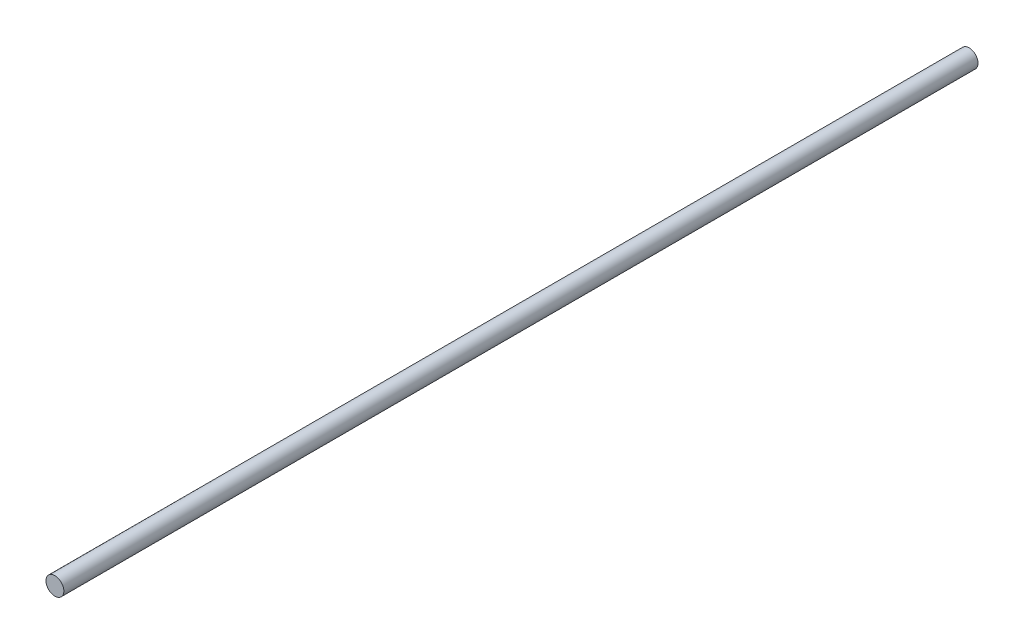
ISO-10303-21;
HEADER;
FILE_DESCRIPTION(('STEP AP214'),'2;1');
FILE_NAME('part.step','',(''),(''),'','','');
FILE_SCHEMA(('AUTOMOTIVE_DESIGN { 1 0 10303 214 1 1 1 1 }'));
ENDSEC;
DATA;
#1=APPLICATION_CONTEXT('core data for automotive mechanical design processes');
#2=APPLICATION_PROTOCOL_DEFINITION('international standard','automotive_design',2000,#1);
#3=PRODUCT_CONTEXT('',#1,'mechanical');
#4=PRODUCT('Part','Part','',(#3));
#5=PRODUCT_RELATED_PRODUCT_CATEGORY('part','',(#4));
#6=PRODUCT_DEFINITION_FORMATION('','',#4);
#7=PRODUCT_DEFINITION_CONTEXT('part definition',#1,'design');
#8=PRODUCT_DEFINITION('design','',#6,#7);
#9=PRODUCT_DEFINITION_SHAPE('','',#8);
#10=(LENGTH_UNIT() NAMED_UNIT(*) SI_UNIT(.MILLI.,.METRE.));
#11=(NAMED_UNIT(*) PLANE_ANGLE_UNIT() SI_UNIT($,.RADIAN.));
#12=(NAMED_UNIT(*) SI_UNIT($,.STERADIAN.) SOLID_ANGLE_UNIT());
#13=UNCERTAINTY_MEASURE_WITH_UNIT(LENGTH_MEASURE(1.E-05),#10,'distance_accuracy_value','');
#14=(GEOMETRIC_REPRESENTATION_CONTEXT(3) GLOBAL_UNCERTAINTY_ASSIGNED_CONTEXT((#13)) GLOBAL_UNIT_ASSIGNED_CONTEXT((#10,
#11,#12)) REPRESENTATION_CONTEXT('',''));
#15=CARTESIAN_POINT('',(0.,0.,0.));
#16=DIRECTION('',(0.,0.,1.));
#17=DIRECTION('',(1.,0.,0.));
#18=AXIS2_PLACEMENT_3D('',#15,#16,#17);
#19=CARTESIAN_POINT('',(0.,0.,410.));
#20=DIRECTION('',(0.,0.,-1.));
#21=DIRECTION('',(-1.,0.,0.));
#22=AXIS2_PLACEMENT_3D('',#19,#20,#21);
#23=CYLINDRICAL_SURFACE('',#22,4.);
#24=CARTESIAN_POINT('',(0.,0.,410.));
#25=DIRECTION('',(0.,0.,1.));
#26=DIRECTION('',(1.,0.,0.));
#27=AXIS2_PLACEMENT_3D('',#24,#25,#26);
#28=CIRCLE('',#27,4.);
#29=CARTESIAN_POINT('',(4.,0.,410.));
#30=VERTEX_POINT('',#29);
#31=EDGE_CURVE('E10',#30,#30,#28,.T.);
#32=ORIENTED_EDGE('',*,*,#31,.F.);
#33=EDGE_LOOP('',(#32));
#34=FACE_BOUND('',#33,.T.);
#35=CARTESIAN_POINT('',(0.,0.,0.));
#36=DIRECTION('',(0.,0.,1.));
#37=DIRECTION('',(1.,0.,0.));
#38=AXIS2_PLACEMENT_3D('',#35,#36,#37);
#39=CIRCLE('',#38,4.);
#40=CARTESIAN_POINT('',(4.,0.,0.));
#41=VERTEX_POINT('',#40);
#42=EDGE_CURVE('E35',#41,#41,#39,.T.);
#43=ORIENTED_EDGE('',*,*,#42,.T.);
#44=EDGE_LOOP('',(#43));
#45=FACE_BOUND('',#44,.T.);
#46=ADVANCED_FACE('F32',(#34,#45),#23,.T.);
#47=CARTESIAN_POINT('',(0.,0.,410.));
#48=DIRECTION('',(0.,0.,1.));
#49=DIRECTION('',(1.,0.,0.));
#50=AXIS2_PLACEMENT_3D('',#47,#48,#49);
#51=PLANE('',#50);
#52=ORIENTED_EDGE('',*,*,#31,.T.);
#53=EDGE_LOOP('',(#52));
#54=FACE_BOUND('',#53,.T.);
#55=ADVANCED_FACE('F47',(#54),#51,.T.);
#56=CARTESIAN_POINT('',(0.,0.,0.));
#57=DIRECTION('',(0.,0.,1.));
#58=DIRECTION('',(1.,0.,0.));
#59=AXIS2_PLACEMENT_3D('',#56,#57,#58);
#60=PLANE('',#59);
#61=ORIENTED_EDGE('',*,*,#42,.F.);
#62=EDGE_LOOP('',(#61));
#63=FACE_BOUND('',#62,.T.);
#64=ADVANCED_FACE('F45',(#63),#60,.F.);
#65=CLOSED_SHELL('',(#46,#55,#64));
#66=MANIFOLD_SOLID_BREP('B2',#65);
#67=ADVANCED_BREP_SHAPE_REPRESENTATION('',(#18,#66),#14);
#68=SHAPE_DEFINITION_REPRESENTATION(#9,#67);
ENDSEC;
END-ISO-10303-21;
